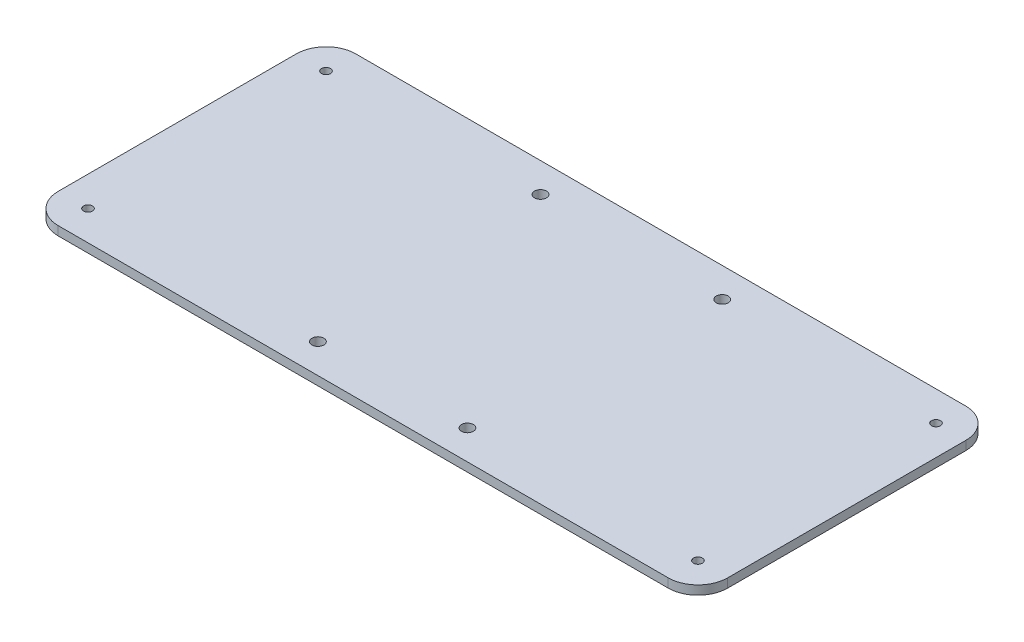
ISO-10303-21;
HEADER;
FILE_DESCRIPTION(('STEP AP214'),'2;1');
FILE_NAME('part.step','',(''),(''),'','','');
FILE_SCHEMA(('AUTOMOTIVE_DESIGN { 1 0 10303 214 1 1 1 1 }'));
ENDSEC;
DATA;
#1=APPLICATION_CONTEXT('core data for automotive mechanical design processes');
#2=APPLICATION_PROTOCOL_DEFINITION('international standard','automotive_design',2000,#1);
#3=PRODUCT_CONTEXT('',#1,'mechanical');
#4=PRODUCT('Part','Part','',(#3));
#5=PRODUCT_RELATED_PRODUCT_CATEGORY('part','',(#4));
#6=PRODUCT_DEFINITION_FORMATION('','',#4);
#7=PRODUCT_DEFINITION_CONTEXT('part definition',#1,'design');
#8=PRODUCT_DEFINITION('design','',#6,#7);
#9=PRODUCT_DEFINITION_SHAPE('','',#8);
#10=(LENGTH_UNIT() NAMED_UNIT(*) SI_UNIT(.MILLI.,.METRE.));
#11=(NAMED_UNIT(*) PLANE_ANGLE_UNIT() SI_UNIT($,.RADIAN.));
#12=(NAMED_UNIT(*) SI_UNIT($,.STERADIAN.) SOLID_ANGLE_UNIT());
#13=UNCERTAINTY_MEASURE_WITH_UNIT(LENGTH_MEASURE(1.E-05),#10,'distance_accuracy_value','');
#14=(GEOMETRIC_REPRESENTATION_CONTEXT(3) GLOBAL_UNCERTAINTY_ASSIGNED_CONTEXT((#13)) GLOBAL_UNIT_ASSIGNED_CONTEXT((#10,
#11,#12)) REPRESENTATION_CONTEXT('',''));
#15=CARTESIAN_POINT('',(0.,0.,0.));
#16=DIRECTION('',(0.,0.,1.));
#17=DIRECTION('',(1.,0.,0.));
#18=AXIS2_PLACEMENT_3D('',#15,#16,#17);
#19=CARTESIAN_POINT('',(0.,3.,0.));
#20=DIRECTION('',(0.,1.,0.));
#21=DIRECTION('',(0.,0.,1.));
#22=AXIS2_PLACEMENT_3D('',#19,#20,#21);
#23=PLANE('',#22);
#24=CARTESIAN_POINT('',(25.125,3.,40.11));
#25=DIRECTION('',(0.,1.,0.));
#26=DIRECTION('',(0.,0.,1.));
#27=AXIS2_PLACEMENT_3D('',#24,#25,#26);
#28=CIRCLE('',#27,2.);
#29=CARTESIAN_POINT('',(25.125,3.,42.11));
#30=VERTEX_POINT('',#29);
#31=EDGE_CURVE('E315',#30,#30,#28,.T.);
#32=ORIENTED_EDGE('',*,*,#31,.F.);
#33=EDGE_LOOP('',(#32));
#34=FACE_BOUND('',#33,.T.);
#35=CARTESIAN_POINT('',(-30.535,3.,-40.11));
#36=DIRECTION('',(0.,1.,0.));
#37=DIRECTION('',(0.,0.,1.));
#38=AXIS2_PLACEMENT_3D('',#35,#36,#37);
#39=CIRCLE('',#38,2.);
#40=CARTESIAN_POINT('',(-30.535,3.,-38.11));
#41=VERTEX_POINT('',#40);
#42=EDGE_CURVE('E304',#41,#41,#39,.T.);
#43=ORIENTED_EDGE('',*,*,#42,.F.);
#44=EDGE_LOOP('',(#43));
#45=FACE_BOUND('',#44,.T.);
#46=CARTESIAN_POINT('',(-102.5,3.,40.));
#47=DIRECTION('',(0.,1.,0.));
#48=DIRECTION('',(0.,0.,1.));
#49=AXIS2_PLACEMENT_3D('',#46,#47,#48);
#50=CIRCLE('',#49,1.5);
#51=CARTESIAN_POINT('',(-102.5,3.,41.5));
#52=VERTEX_POINT('',#51);
#53=EDGE_CURVE('E283',#52,#52,#50,.T.);
#54=ORIENTED_EDGE('',*,*,#53,.F.);
#55=EDGE_LOOP('',(#54));
#56=FACE_BOUND('',#55,.T.);
#57=CARTESIAN_POINT('',(-102.5,3.,-40.));
#58=DIRECTION('',(0.,1.,0.));
#59=DIRECTION('',(0.,0.,1.));
#60=AXIS2_PLACEMENT_3D('',#57,#58,#59);
#61=CIRCLE('',#60,1.5);
#62=CARTESIAN_POINT('',(-102.5,3.,-38.5));
#63=VERTEX_POINT('',#62);
#64=EDGE_CURVE('E195',#63,#63,#61,.T.);
#65=ORIENTED_EDGE('',*,*,#64,.F.);
#66=EDGE_LOOP('',(#65));
#67=FACE_BOUND('',#66,.T.);
#68=DIRECTION('',(-1.,0.,0.));
#69=VECTOR('',#68,1.);
#70=CARTESIAN_POINT('',(-112.5,3.,-50.));
#71=LINE('',#70,#69);
#72=CARTESIAN_POINT('',(102.5,3.,-50.));
#73=VERTEX_POINT('',#72);
#74=CARTESIAN_POINT('',(-102.5,3.,-50.));
#75=VERTEX_POINT('',#74);
#76=EDGE_CURVE('E165',#73,#75,#71,.T.);
#77=ORIENTED_EDGE('',*,*,#76,.T.);
#78=CARTESIAN_POINT('',(-102.5,3.,-40.));
#79=DIRECTION('',(0.,1.,0.));
#80=DIRECTION('',(0.,0.,1.));
#81=AXIS2_PLACEMENT_3D('',#78,#79,#80);
#82=CIRCLE('',#81,10.);
#83=CARTESIAN_POINT('',(-112.5,3.,-40.));
#84=VERTEX_POINT('',#83);
#85=EDGE_CURVE('E178',#75,#84,#82,.T.);
#86=ORIENTED_EDGE('',*,*,#85,.T.);
#87=DIRECTION('',(0.,0.,1.));
#88=VECTOR('',#87,1.);
#89=CARTESIAN_POINT('',(-112.5,3.,-50.));
#90=LINE('',#89,#88);
#91=CARTESIAN_POINT('',(-112.5,3.,40.));
#92=VERTEX_POINT('',#91);
#93=EDGE_CURVE('E122',#84,#92,#90,.T.);
#94=ORIENTED_EDGE('',*,*,#93,.T.);
#95=CARTESIAN_POINT('',(-102.5,3.,40.));
#96=DIRECTION('',(0.,1.,0.));
#97=DIRECTION('',(0.,0.,1.));
#98=AXIS2_PLACEMENT_3D('',#95,#96,#97);
#99=CIRCLE('',#98,10.);
#100=CARTESIAN_POINT('',(-102.5,3.,50.));
#101=VERTEX_POINT('',#100);
#102=EDGE_CURVE('E59',#92,#101,#99,.T.);
#103=ORIENTED_EDGE('',*,*,#102,.T.);
#104=DIRECTION('',(1.,0.,0.));
#105=VECTOR('',#104,1.);
#106=CARTESIAN_POINT('',(-112.5,3.,50.));
#107=LINE('',#106,#105);
#108=CARTESIAN_POINT('',(102.5,3.,50.));
#109=VERTEX_POINT('',#108);
#110=EDGE_CURVE('E138',#101,#109,#107,.T.);
#111=ORIENTED_EDGE('',*,*,#110,.T.);
#112=CARTESIAN_POINT('',(102.5,3.,40.));
#113=DIRECTION('',(0.,1.,0.));
#114=DIRECTION('',(0.,0.,1.));
#115=AXIS2_PLACEMENT_3D('',#112,#113,#114);
#116=CIRCLE('',#115,10.);
#117=CARTESIAN_POINT('',(112.5,3.,40.));
#118=VERTEX_POINT('',#117);
#119=EDGE_CURVE('E147',#109,#118,#116,.T.);
#120=ORIENTED_EDGE('',*,*,#119,.T.);
#121=DIRECTION('',(0.,0.,-1.));
#122=VECTOR('',#121,1.);
#123=CARTESIAN_POINT('',(112.5,3.,-50.));
#124=LINE('',#123,#122);
#125=CARTESIAN_POINT('',(112.5,3.,-40.));
#126=VERTEX_POINT('',#125);
#127=EDGE_CURVE('E132',#118,#126,#124,.T.);
#128=ORIENTED_EDGE('',*,*,#127,.T.);
#129=CARTESIAN_POINT('',(102.5,3.,-40.));
#130=DIRECTION('',(0.,1.,0.));
#131=DIRECTION('',(0.,0.,1.));
#132=AXIS2_PLACEMENT_3D('',#129,#130,#131);
#133=CIRCLE('',#132,10.);
#134=EDGE_CURVE('E150',#126,#73,#133,.T.);
#135=ORIENTED_EDGE('',*,*,#134,.T.);
#136=EDGE_LOOP('',(#77,#86,#94,#103,#111,#120,#128,#135));
#137=FACE_BOUND('',#136,.T.);
#138=CARTESIAN_POINT('',(102.5,3.,-40.));
#139=DIRECTION('',(0.,1.,0.));
#140=DIRECTION('',(0.,0.,1.));
#141=AXIS2_PLACEMENT_3D('',#138,#139,#140);
#142=CIRCLE('',#141,1.5);
#143=CARTESIAN_POINT('',(102.5,3.,-38.5));
#144=VERTEX_POINT('',#143);
#145=EDGE_CURVE('E278',#144,#144,#142,.T.);
#146=ORIENTED_EDGE('',*,*,#145,.F.);
#147=EDGE_LOOP('',(#146));
#148=FACE_BOUND('',#147,.T.);
#149=CARTESIAN_POINT('',(102.5,3.,40.));
#150=DIRECTION('',(0.,1.,0.));
#151=DIRECTION('',(0.,0.,1.));
#152=AXIS2_PLACEMENT_3D('',#149,#150,#151);
#153=CIRCLE('',#152,1.5);
#154=CARTESIAN_POINT('',(102.5,3.,41.5));
#155=VERTEX_POINT('',#154);
#156=EDGE_CURVE('E295',#155,#155,#153,.T.);
#157=ORIENTED_EDGE('',*,*,#156,.F.);
#158=EDGE_LOOP('',(#157));
#159=FACE_BOUND('',#158,.T.);
#160=CARTESIAN_POINT('',(30.535,3.,-40.11));
#161=DIRECTION('',(0.,1.,0.));
#162=DIRECTION('',(0.,0.,1.));
#163=AXIS2_PLACEMENT_3D('',#160,#161,#162);
#164=CIRCLE('',#163,2.);
#165=CARTESIAN_POINT('',(30.535,3.,-38.11));
#166=VERTEX_POINT('',#165);
#167=EDGE_CURVE('E314',#166,#166,#164,.T.);
#168=ORIENTED_EDGE('',*,*,#167,.F.);
#169=EDGE_LOOP('',(#168));
#170=FACE_BOUND('',#169,.T.);
#171=CARTESIAN_POINT('',(-25.125,3.,40.11));
#172=DIRECTION('',(0.,1.,0.));
#173=DIRECTION('',(0.,0.,1.));
#174=AXIS2_PLACEMENT_3D('',#171,#172,#173);
#175=CIRCLE('',#174,2.);
#176=CARTESIAN_POINT('',(-25.125,3.,42.11));
#177=VERTEX_POINT('',#176);
#178=EDGE_CURVE('E321',#177,#177,#175,.T.);
#179=ORIENTED_EDGE('',*,*,#178,.F.);
#180=EDGE_LOOP('',(#179));
#181=FACE_BOUND('',#180,.T.);
#182=ADVANCED_FACE('F37',(#34,#45,#56,#67,#137,#148,#159,#170,#181),#23,.T.);
#183=CARTESIAN_POINT('',(0.,0.,0.));
#184=DIRECTION('',(0.,1.,0.));
#185=DIRECTION('',(0.,0.,1.));
#186=AXIS2_PLACEMENT_3D('',#183,#184,#185);
#187=PLANE('',#186);
#188=DIRECTION('',(0.,0.,1.));
#189=VECTOR('',#188,1.);
#190=CARTESIAN_POINT('',(-112.5,0.,-50.));
#191=LINE('',#190,#189);
#192=CARTESIAN_POINT('',(-112.5,0.,-40.));
#193=VERTEX_POINT('',#192);
#194=CARTESIAN_POINT('',(-112.5,0.,40.));
#195=VERTEX_POINT('',#194);
#196=EDGE_CURVE('E120',#193,#195,#191,.T.);
#197=ORIENTED_EDGE('',*,*,#196,.F.);
#198=CARTESIAN_POINT('',(-102.5,0.,-40.));
#199=DIRECTION('',(0.,1.,0.));
#200=DIRECTION('',(0.,0.,1.));
#201=AXIS2_PLACEMENT_3D('',#198,#199,#200);
#202=CIRCLE('',#201,10.);
#203=CARTESIAN_POINT('',(-102.5,0.,-50.));
#204=VERTEX_POINT('',#203);
#205=EDGE_CURVE('E103',#193,#204,#202,.F.);
#206=ORIENTED_EDGE('',*,*,#205,.T.);
#207=DIRECTION('',(-1.,0.,0.));
#208=VECTOR('',#207,1.);
#209=CARTESIAN_POINT('',(-112.5,0.,-50.));
#210=LINE('',#209,#208);
#211=CARTESIAN_POINT('',(102.5,0.,-50.));
#212=VERTEX_POINT('',#211);
#213=EDGE_CURVE('E130',#212,#204,#210,.T.);
#214=ORIENTED_EDGE('',*,*,#213,.F.);
#215=CARTESIAN_POINT('',(102.5,0.,-40.));
#216=DIRECTION('',(0.,1.,0.));
#217=DIRECTION('',(0.,0.,1.));
#218=AXIS2_PLACEMENT_3D('',#215,#216,#217);
#219=CIRCLE('',#218,10.);
#220=CARTESIAN_POINT('',(112.5,0.,-40.));
#221=VERTEX_POINT('',#220);
#222=EDGE_CURVE('E141',#212,#221,#219,.F.);
#223=ORIENTED_EDGE('',*,*,#222,.T.);
#224=DIRECTION('',(0.,0.,-1.));
#225=VECTOR('',#224,1.);
#226=CARTESIAN_POINT('',(112.5,0.,-50.));
#227=LINE('',#226,#225);
#228=CARTESIAN_POINT('',(112.5,0.,40.));
#229=VERTEX_POINT('',#228);
#230=EDGE_CURVE('E134',#229,#221,#227,.T.);
#231=ORIENTED_EDGE('',*,*,#230,.F.);
#232=CARTESIAN_POINT('',(102.5,0.,40.));
#233=DIRECTION('',(0.,1.,0.));
#234=DIRECTION('',(0.,0.,1.));
#235=AXIS2_PLACEMENT_3D('',#232,#233,#234);
#236=CIRCLE('',#235,10.);
#237=CARTESIAN_POINT('',(102.5,0.,50.));
#238=VERTEX_POINT('',#237);
#239=EDGE_CURVE('E123',#229,#238,#236,.F.);
#240=ORIENTED_EDGE('',*,*,#239,.T.);
#241=DIRECTION('',(1.,0.,0.));
#242=VECTOR('',#241,1.);
#243=CARTESIAN_POINT('',(-112.5,0.,50.));
#244=LINE('',#243,#242);
#245=CARTESIAN_POINT('',(-102.5,0.,50.));
#246=VERTEX_POINT('',#245);
#247=EDGE_CURVE('E129',#246,#238,#244,.T.);
#248=ORIENTED_EDGE('',*,*,#247,.F.);
#249=CARTESIAN_POINT('',(-102.5,0.,40.));
#250=DIRECTION('',(0.,1.,0.));
#251=DIRECTION('',(0.,0.,1.));
#252=AXIS2_PLACEMENT_3D('',#249,#250,#251);
#253=CIRCLE('',#252,10.);
#254=EDGE_CURVE('E114',#246,#195,#253,.F.);
#255=ORIENTED_EDGE('',*,*,#254,.T.);
#256=EDGE_LOOP('',(#197,#206,#214,#223,#231,#240,#248,#255));
#257=FACE_BOUND('',#256,.T.);
#258=CARTESIAN_POINT('',(-102.5,0.,-40.));
#259=DIRECTION('',(0.,1.,0.));
#260=DIRECTION('',(0.,0.,1.));
#261=AXIS2_PLACEMENT_3D('',#258,#259,#260);
#262=CIRCLE('',#261,1.5);
#263=CARTESIAN_POINT('',(-102.5,0.,-38.5));
#264=VERTEX_POINT('',#263);
#265=EDGE_CURVE('E166',#264,#264,#262,.T.);
#266=ORIENTED_EDGE('',*,*,#265,.T.);
#267=EDGE_LOOP('',(#266));
#268=FACE_BOUND('',#267,.T.);
#269=CARTESIAN_POINT('',(102.5,0.,-40.));
#270=DIRECTION('',(0.,1.,0.));
#271=DIRECTION('',(0.,0.,1.));
#272=AXIS2_PLACEMENT_3D('',#269,#270,#271);
#273=CIRCLE('',#272,1.5);
#274=CARTESIAN_POINT('',(102.5,0.,-38.5));
#275=VERTEX_POINT('',#274);
#276=EDGE_CURVE('E281',#275,#275,#273,.T.);
#277=ORIENTED_EDGE('',*,*,#276,.T.);
#278=EDGE_LOOP('',(#277));
#279=FACE_BOUND('',#278,.T.);
#280=CARTESIAN_POINT('',(-102.5,0.,40.));
#281=DIRECTION('',(0.,1.,0.));
#282=DIRECTION('',(0.,0.,1.));
#283=AXIS2_PLACEMENT_3D('',#280,#281,#282);
#284=CIRCLE('',#283,1.5);
#285=CARTESIAN_POINT('',(-102.5,0.,41.5));
#286=VERTEX_POINT('',#285);
#287=EDGE_CURVE('E287',#286,#286,#284,.T.);
#288=ORIENTED_EDGE('',*,*,#287,.T.);
#289=EDGE_LOOP('',(#288));
#290=FACE_BOUND('',#289,.T.);
#291=CARTESIAN_POINT('',(102.5,0.,40.));
#292=DIRECTION('',(0.,1.,0.));
#293=DIRECTION('',(0.,0.,1.));
#294=AXIS2_PLACEMENT_3D('',#291,#292,#293);
#295=CIRCLE('',#294,1.5);
#296=CARTESIAN_POINT('',(102.5,0.,41.5));
#297=VERTEX_POINT('',#296);
#298=EDGE_CURVE('E300',#297,#297,#295,.T.);
#299=ORIENTED_EDGE('',*,*,#298,.T.);
#300=EDGE_LOOP('',(#299));
#301=FACE_BOUND('',#300,.T.);
#302=CARTESIAN_POINT('',(-30.535,0.,-40.11));
#303=DIRECTION('',(0.,1.,0.));
#304=DIRECTION('',(0.,0.,1.));
#305=AXIS2_PLACEMENT_3D('',#302,#303,#304);
#306=CIRCLE('',#305,2.);
#307=CARTESIAN_POINT('',(-30.535,0.,-38.11));
#308=VERTEX_POINT('',#307);
#309=EDGE_CURVE('E301',#308,#308,#306,.T.);
#310=ORIENTED_EDGE('',*,*,#309,.T.);
#311=EDGE_LOOP('',(#310));
#312=FACE_BOUND('',#311,.T.);
#313=CARTESIAN_POINT('',(30.535,0.,-40.11));
#314=DIRECTION('',(0.,1.,0.));
#315=DIRECTION('',(0.,0.,1.));
#316=AXIS2_PLACEMENT_3D('',#313,#314,#315);
#317=CIRCLE('',#316,2.);
#318=CARTESIAN_POINT('',(30.535,0.,-38.11));
#319=VERTEX_POINT('',#318);
#320=EDGE_CURVE('E312',#319,#319,#317,.T.);
#321=ORIENTED_EDGE('',*,*,#320,.T.);
#322=EDGE_LOOP('',(#321));
#323=FACE_BOUND('',#322,.T.);
#324=CARTESIAN_POINT('',(25.125,0.,40.11));
#325=DIRECTION('',(0.,1.,0.));
#326=DIRECTION('',(0.,0.,1.));
#327=AXIS2_PLACEMENT_3D('',#324,#325,#326);
#328=CIRCLE('',#327,2.);
#329=CARTESIAN_POINT('',(25.125,0.,42.11));
#330=VERTEX_POINT('',#329);
#331=EDGE_CURVE('E319',#330,#330,#328,.T.);
#332=ORIENTED_EDGE('',*,*,#331,.T.);
#333=EDGE_LOOP('',(#332));
#334=FACE_BOUND('',#333,.T.);
#335=CARTESIAN_POINT('',(-25.125,0.,40.11));
#336=DIRECTION('',(0.,1.,0.));
#337=DIRECTION('',(0.,0.,1.));
#338=AXIS2_PLACEMENT_3D('',#335,#336,#337);
#339=CIRCLE('',#338,2.);
#340=CARTESIAN_POINT('',(-25.125,0.,42.11));
#341=VERTEX_POINT('',#340);
#342=EDGE_CURVE('E325',#341,#341,#339,.T.);
#343=ORIENTED_EDGE('',*,*,#342,.T.);
#344=EDGE_LOOP('',(#343));
#345=FACE_BOUND('',#344,.T.);
#346=ADVANCED_FACE('F126',(#257,#268,#279,#290,#301,#312,#323,#334,#345),#187,.F.);
#347=CARTESIAN_POINT('',(112.5,3.,-50.));
#348=DIRECTION('',(-1.,0.,0.));
#349=DIRECTION('',(0.,0.,1.));
#350=AXIS2_PLACEMENT_3D('',#347,#348,#349);
#351=PLANE('',#350);
#352=ORIENTED_EDGE('',*,*,#230,.T.);
#353=DIRECTION('',(0.,-1.,0.));
#354=VECTOR('',#353,1.);
#355=CARTESIAN_POINT('',(112.5,3.,-40.));
#356=LINE('',#355,#354);
#357=EDGE_CURVE('E12',#221,#126,#356,.F.);
#358=ORIENTED_EDGE('',*,*,#357,.T.);
#359=ORIENTED_EDGE('',*,*,#127,.F.);
#360=DIRECTION('',(0.,-1.,0.));
#361=VECTOR('',#360,1.);
#362=CARTESIAN_POINT('',(112.5,3.,40.));
#363=LINE('',#362,#361);
#364=EDGE_CURVE('E45',#118,#229,#363,.T.);
#365=ORIENTED_EDGE('',*,*,#364,.T.);
#366=EDGE_LOOP('',(#352,#358,#359,#365));
#367=FACE_BOUND('',#366,.T.);
#368=ADVANCED_FACE('F191',(#367),#351,.F.);
#369=CARTESIAN_POINT('',(-112.5,3.,-50.));
#370=DIRECTION('',(0.,0.,1.));
#371=DIRECTION('',(1.,0.,0.));
#372=AXIS2_PLACEMENT_3D('',#369,#370,#371);
#373=PLANE('',#372);
#374=ORIENTED_EDGE('',*,*,#213,.T.);
#375=DIRECTION('',(0.,-1.,0.));
#376=VECTOR('',#375,1.);
#377=CARTESIAN_POINT('',(-102.5,3.,-50.));
#378=LINE('',#377,#376);
#379=EDGE_CURVE('E108',#204,#75,#378,.F.);
#380=ORIENTED_EDGE('',*,*,#379,.T.);
#381=ORIENTED_EDGE('',*,*,#76,.F.);
#382=DIRECTION('',(0.,-1.,0.));
#383=VECTOR('',#382,1.);
#384=CARTESIAN_POINT('',(102.5,3.,-50.));
#385=LINE('',#384,#383);
#386=EDGE_CURVE('E113',#73,#212,#385,.T.);
#387=ORIENTED_EDGE('',*,*,#386,.T.);
#388=EDGE_LOOP('',(#374,#380,#381,#387));
#389=FACE_BOUND('',#388,.T.);
#390=ADVANCED_FACE('F207',(#389),#373,.F.);
#391=CARTESIAN_POINT('',(-112.5,3.,-50.));
#392=DIRECTION('',(1.,0.,0.));
#393=DIRECTION('',(0.,0.,-1.));
#394=AXIS2_PLACEMENT_3D('',#391,#392,#393);
#395=PLANE('',#394);
#396=ORIENTED_EDGE('',*,*,#93,.F.);
#397=DIRECTION('',(0.,-1.,0.));
#398=VECTOR('',#397,1.);
#399=CARTESIAN_POINT('',(-112.5,3.,-40.));
#400=LINE('',#399,#398);
#401=EDGE_CURVE('E107',#84,#193,#400,.T.);
#402=ORIENTED_EDGE('',*,*,#401,.T.);
#403=ORIENTED_EDGE('',*,*,#196,.T.);
#404=DIRECTION('',(0.,-1.,0.));
#405=VECTOR('',#404,1.);
#406=CARTESIAN_POINT('',(-112.5,3.,40.));
#407=LINE('',#406,#405);
#408=EDGE_CURVE('E124',#195,#92,#407,.F.);
#409=ORIENTED_EDGE('',*,*,#408,.T.);
#410=EDGE_LOOP('',(#396,#402,#403,#409));
#411=FACE_BOUND('',#410,.T.);
#412=ADVANCED_FACE('F119',(#411),#395,.F.);
#413=CARTESIAN_POINT('',(-112.5,3.,50.));
#414=DIRECTION('',(0.,0.,-1.));
#415=DIRECTION('',(-1.,0.,0.));
#416=AXIS2_PLACEMENT_3D('',#413,#414,#415);
#417=PLANE('',#416);
#418=ORIENTED_EDGE('',*,*,#110,.F.);
#419=DIRECTION('',(0.,-1.,0.));
#420=VECTOR('',#419,1.);
#421=CARTESIAN_POINT('',(-102.5,3.,50.));
#422=LINE('',#421,#420);
#423=EDGE_CURVE('E183',#101,#246,#422,.T.);
#424=ORIENTED_EDGE('',*,*,#423,.T.);
#425=ORIENTED_EDGE('',*,*,#247,.T.);
#426=DIRECTION('',(0.,-1.,0.));
#427=VECTOR('',#426,1.);
#428=CARTESIAN_POINT('',(102.5,3.,50.));
#429=LINE('',#428,#427);
#430=EDGE_CURVE('E52',#238,#109,#429,.F.);
#431=ORIENTED_EDGE('',*,*,#430,.T.);
#432=EDGE_LOOP('',(#418,#424,#425,#431));
#433=FACE_BOUND('',#432,.T.);
#434=ADVANCED_FACE('F228',(#433),#417,.F.);
#435=CARTESIAN_POINT('',(-102.5,3.,-40.));
#436=DIRECTION('',(0.,-1.,0.));
#437=DIRECTION('',(0.,0.,-1.));
#438=AXIS2_PLACEMENT_3D('',#435,#436,#437);
#439=CYLINDRICAL_SURFACE('',#438,1.5);
#440=ORIENTED_EDGE('',*,*,#64,.T.);
#441=EDGE_LOOP('',(#440));
#442=FACE_BOUND('',#441,.T.);
#443=ORIENTED_EDGE('',*,*,#265,.F.);
#444=EDGE_LOOP('',(#443));
#445=FACE_BOUND('',#444,.T.);
#446=ADVANCED_FACE('F225',(#442,#445),#439,.F.);
#447=CARTESIAN_POINT('',(102.5,3.,-40.));
#448=DIRECTION('',(0.,-1.,0.));
#449=DIRECTION('',(0.,0.,-1.));
#450=AXIS2_PLACEMENT_3D('',#447,#448,#449);
#451=CYLINDRICAL_SURFACE('',#450,1.5);
#452=ORIENTED_EDGE('',*,*,#145,.T.);
#453=EDGE_LOOP('',(#452));
#454=FACE_BOUND('',#453,.T.);
#455=ORIENTED_EDGE('',*,*,#276,.F.);
#456=EDGE_LOOP('',(#455));
#457=FACE_BOUND('',#456,.T.);
#458=ADVANCED_FACE('F267',(#454,#457),#451,.F.);
#459=CARTESIAN_POINT('',(-102.5,3.,40.));
#460=DIRECTION('',(0.,-1.,0.));
#461=DIRECTION('',(0.,0.,-1.));
#462=AXIS2_PLACEMENT_3D('',#459,#460,#461);
#463=CYLINDRICAL_SURFACE('',#462,1.5);
#464=ORIENTED_EDGE('',*,*,#53,.T.);
#465=EDGE_LOOP('',(#464));
#466=FACE_BOUND('',#465,.T.);
#467=ORIENTED_EDGE('',*,*,#287,.F.);
#468=EDGE_LOOP('',(#467));
#469=FACE_BOUND('',#468,.T.);
#470=ADVANCED_FACE('F264',(#466,#469),#463,.F.);
#471=CARTESIAN_POINT('',(102.5,3.,40.));
#472=DIRECTION('',(0.,-1.,0.));
#473=DIRECTION('',(0.,0.,-1.));
#474=AXIS2_PLACEMENT_3D('',#471,#472,#473);
#475=CYLINDRICAL_SURFACE('',#474,1.5);
#476=ORIENTED_EDGE('',*,*,#156,.T.);
#477=EDGE_LOOP('',(#476));
#478=FACE_BOUND('',#477,.T.);
#479=ORIENTED_EDGE('',*,*,#298,.F.);
#480=EDGE_LOOP('',(#479));
#481=FACE_BOUND('',#480,.T.);
#482=ADVANCED_FACE('F260',(#478,#481),#475,.F.);
#483=CARTESIAN_POINT('',(-30.535,3.,-40.11));
#484=DIRECTION('',(0.,-1.,0.));
#485=DIRECTION('',(0.,0.,-1.));
#486=AXIS2_PLACEMENT_3D('',#483,#484,#485);
#487=CYLINDRICAL_SURFACE('',#486,2.);
#488=ORIENTED_EDGE('',*,*,#42,.T.);
#489=EDGE_LOOP('',(#488));
#490=FACE_BOUND('',#489,.T.);
#491=ORIENTED_EDGE('',*,*,#309,.F.);
#492=EDGE_LOOP('',(#491));
#493=FACE_BOUND('',#492,.T.);
#494=ADVANCED_FACE('F256',(#490,#493),#487,.F.);
#495=CARTESIAN_POINT('',(30.535,3.,-40.11));
#496=DIRECTION('',(0.,-1.,0.));
#497=DIRECTION('',(0.,0.,-1.));
#498=AXIS2_PLACEMENT_3D('',#495,#496,#497);
#499=CYLINDRICAL_SURFACE('',#498,2.);
#500=ORIENTED_EDGE('',*,*,#167,.T.);
#501=EDGE_LOOP('',(#500));
#502=FACE_BOUND('',#501,.T.);
#503=ORIENTED_EDGE('',*,*,#320,.F.);
#504=EDGE_LOOP('',(#503));
#505=FACE_BOUND('',#504,.T.);
#506=ADVANCED_FACE('F248',(#502,#505),#499,.F.);
#507=CARTESIAN_POINT('',(25.125,3.,40.11));
#508=DIRECTION('',(0.,-1.,0.));
#509=DIRECTION('',(0.,0.,-1.));
#510=AXIS2_PLACEMENT_3D('',#507,#508,#509);
#511=CYLINDRICAL_SURFACE('',#510,2.);
#512=ORIENTED_EDGE('',*,*,#31,.T.);
#513=EDGE_LOOP('',(#512));
#514=FACE_BOUND('',#513,.T.);
#515=ORIENTED_EDGE('',*,*,#331,.F.);
#516=EDGE_LOOP('',(#515));
#517=FACE_BOUND('',#516,.T.);
#518=ADVANCED_FACE('F242',(#514,#517),#511,.F.);
#519=CARTESIAN_POINT('',(-25.125,3.,40.11));
#520=DIRECTION('',(0.,-1.,0.));
#521=DIRECTION('',(0.,0.,-1.));
#522=AXIS2_PLACEMENT_3D('',#519,#520,#521);
#523=CYLINDRICAL_SURFACE('',#522,2.);
#524=ORIENTED_EDGE('',*,*,#178,.T.);
#525=EDGE_LOOP('',(#524));
#526=FACE_BOUND('',#525,.T.);
#527=ORIENTED_EDGE('',*,*,#342,.F.);
#528=EDGE_LOOP('',(#527));
#529=FACE_BOUND('',#528,.T.);
#530=ADVANCED_FACE('F238',(#526,#529),#523,.F.);
#531=CARTESIAN_POINT('',(-102.5,3.,-40.));
#532=DIRECTION('',(0.,-1.,0.));
#533=DIRECTION('',(0.,0.,-1.));
#534=AXIS2_PLACEMENT_3D('',#531,#532,#533);
#535=CYLINDRICAL_SURFACE('',#534,10.);
#536=ORIENTED_EDGE('',*,*,#85,.F.);
#537=ORIENTED_EDGE('',*,*,#379,.F.);
#538=ORIENTED_EDGE('',*,*,#205,.F.);
#539=ORIENTED_EDGE('',*,*,#401,.F.);
#540=EDGE_LOOP('',(#536,#537,#538,#539));
#541=FACE_BOUND('',#540,.T.);
#542=ADVANCED_FACE('F106',(#541),#535,.T.);
#543=CARTESIAN_POINT('',(-102.5,3.,40.));
#544=DIRECTION('',(0.,-1.,0.));
#545=DIRECTION('',(0.,0.,-1.));
#546=AXIS2_PLACEMENT_3D('',#543,#544,#545);
#547=CYLINDRICAL_SURFACE('',#546,10.);
#548=ORIENTED_EDGE('',*,*,#102,.F.);
#549=ORIENTED_EDGE('',*,*,#408,.F.);
#550=ORIENTED_EDGE('',*,*,#254,.F.);
#551=ORIENTED_EDGE('',*,*,#423,.F.);
#552=EDGE_LOOP('',(#548,#549,#550,#551));
#553=FACE_BOUND('',#552,.T.);
#554=ADVANCED_FACE('F201',(#553),#547,.T.);
#555=CARTESIAN_POINT('',(102.5,3.,-40.));
#556=DIRECTION('',(0.,-1.,0.));
#557=DIRECTION('',(0.,0.,-1.));
#558=AXIS2_PLACEMENT_3D('',#555,#556,#557);
#559=CYLINDRICAL_SURFACE('',#558,10.);
#560=ORIENTED_EDGE('',*,*,#134,.F.);
#561=ORIENTED_EDGE('',*,*,#357,.F.);
#562=ORIENTED_EDGE('',*,*,#222,.F.);
#563=ORIENTED_EDGE('',*,*,#386,.F.);
#564=EDGE_LOOP('',(#560,#561,#562,#563));
#565=FACE_BOUND('',#564,.T.);
#566=ADVANCED_FACE('F208',(#565),#559,.T.);
#567=CARTESIAN_POINT('',(102.5,3.,40.));
#568=DIRECTION('',(0.,-1.,0.));
#569=DIRECTION('',(0.,0.,-1.));
#570=AXIS2_PLACEMENT_3D('',#567,#568,#569);
#571=CYLINDRICAL_SURFACE('',#570,10.);
#572=ORIENTED_EDGE('',*,*,#119,.F.);
#573=ORIENTED_EDGE('',*,*,#430,.F.);
#574=ORIENTED_EDGE('',*,*,#239,.F.);
#575=ORIENTED_EDGE('',*,*,#364,.F.);
#576=EDGE_LOOP('',(#572,#573,#574,#575));
#577=FACE_BOUND('',#576,.T.);
#578=ADVANCED_FACE('F39',(#577),#571,.T.);
#579=CLOSED_SHELL('',(#182,#346,#368,#390,#412,#434,#446,#458,#470,#482,#494,#506,#518,#530,
#542,#554,#566,#578));
#580=MANIFOLD_SOLID_BREP('B2',#579);
#581=ADVANCED_BREP_SHAPE_REPRESENTATION('',(#18,#580),#14);
#582=SHAPE_DEFINITION_REPRESENTATION(#9,#581);
ENDSEC;
END-ISO-10303-21;
